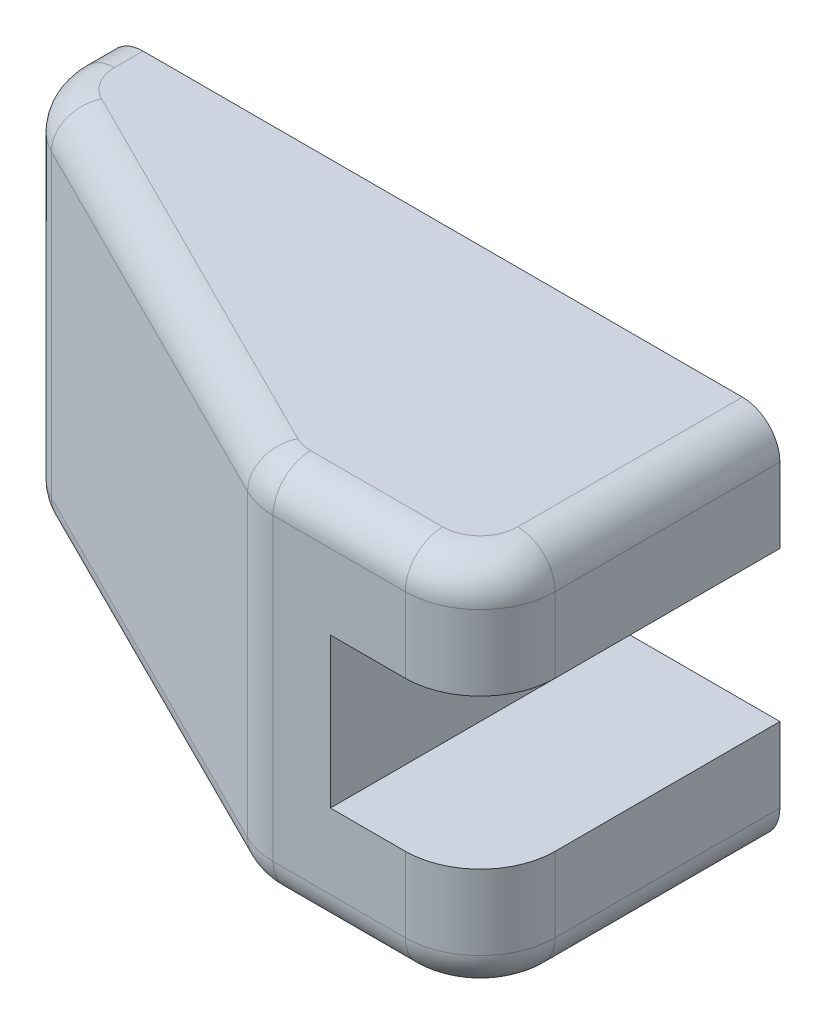
ISO-10303-21;
HEADER;
FILE_DESCRIPTION(('STEP AP214'),'2;1');
FILE_NAME('part.step','',(''),(''),'','','');
FILE_SCHEMA(('AUTOMOTIVE_DESIGN { 1 0 10303 214 1 1 1 1 }'));
ENDSEC;
DATA;
#1=APPLICATION_CONTEXT('core data for automotive mechanical design processes');
#2=APPLICATION_PROTOCOL_DEFINITION('international standard','automotive_design',2000,#1);
#3=PRODUCT_CONTEXT('',#1,'mechanical');
#4=PRODUCT('Part','Part','',(#3));
#5=PRODUCT_RELATED_PRODUCT_CATEGORY('part','',(#4));
#6=PRODUCT_DEFINITION_FORMATION('','',#4);
#7=PRODUCT_DEFINITION_CONTEXT('part definition',#1,'design');
#8=PRODUCT_DEFINITION('design','',#6,#7);
#9=PRODUCT_DEFINITION_SHAPE('','',#8);
#10=(LENGTH_UNIT() NAMED_UNIT(*) SI_UNIT(.MILLI.,.METRE.));
#11=(NAMED_UNIT(*) PLANE_ANGLE_UNIT() SI_UNIT($,.RADIAN.));
#12=(NAMED_UNIT(*) SI_UNIT($,.STERADIAN.) SOLID_ANGLE_UNIT());
#13=UNCERTAINTY_MEASURE_WITH_UNIT(LENGTH_MEASURE(1.E-05),#10,'distance_accuracy_value','');
#14=(GEOMETRIC_REPRESENTATION_CONTEXT(3) GLOBAL_UNCERTAINTY_ASSIGNED_CONTEXT((#13)) GLOBAL_UNIT_ASSIGNED_CONTEXT((#10,
#11,#12)) REPRESENTATION_CONTEXT('',''));
#15=CARTESIAN_POINT('',(0.,0.,0.));
#16=DIRECTION('',(0.,0.,1.));
#17=DIRECTION('',(1.,0.,0.));
#18=AXIS2_PLACEMENT_3D('',#15,#16,#17);
#19=CARTESIAN_POINT('',(-652.,0.,40.));
#20=DIRECTION('',(-1.,0.,0.));
#21=DIRECTION('',(0.,0.,-1.));
#22=AXIS2_PLACEMENT_3D('',#19,#20,#21);
#23=PLANE('',#22);
#24=DIRECTION('',(0.,-1.,0.));
#25=VECTOR('',#24,1.);
#26=CARTESIAN_POINT('',(-652.,0.,0.));
#27=LINE('',#26,#25);
#28=CARTESIAN_POINT('',(-652.,420.,0.));
#29=VERTEX_POINT('',#28);
#30=CARTESIAN_POINT('',(-652.,380.,0.));
#31=VERTEX_POINT('',#30);
#32=EDGE_CURVE('E228',#29,#31,#27,.T.);
#33=ORIENTED_EDGE('',*,*,#32,.T.);
#34=DIRECTION('',(0.,0.,-1.));
#35=VECTOR('',#34,1.);
#36=CARTESIAN_POINT('',(-652.,380.,3.81966011250102));
#37=LINE('',#36,#35);
#38=CARTESIAN_POINT('',(-652.,380.,3.81966011250102));
#39=VERTEX_POINT('',#38);
#40=EDGE_CURVE('E352',#31,#39,#37,.F.);
#41=ORIENTED_EDGE('',*,*,#40,.T.);
#42=DIRECTION('',(0.,1.,0.));
#43=VECTOR('',#42,1.);
#44=CARTESIAN_POINT('',(-652.,0.,3.81966011250102));
#45=LINE('',#44,#43);
#46=CARTESIAN_POINT('',(-652.,420.,3.81966011250102));
#47=VERTEX_POINT('',#46);
#48=EDGE_CURVE('E279',#39,#47,#45,.T.);
#49=ORIENTED_EDGE('',*,*,#48,.T.);
#50=DIRECTION('',(0.,0.,-1.));
#51=VECTOR('',#50,1.);
#52=CARTESIAN_POINT('',(-652.,420.,40.));
#53=LINE('',#52,#51);
#54=EDGE_CURVE('E348',#47,#29,#53,.T.);
#55=ORIENTED_EDGE('',*,*,#54,.T.);
#56=EDGE_LOOP('',(#33,#41,#49,#55));
#57=FACE_BOUND('',#56,.T.);
#58=ADVANCED_FACE('F47',(#57),#23,.T.);
#59=CARTESIAN_POINT('',(0.,425.,40.));
#60=DIRECTION('',(0.,1.,0.));
#61=DIRECTION('',(0.,0.,-1.));
#62=AXIS2_PLACEMENT_3D('',#59,#60,#61);
#63=PLANE('',#62);
#64=DIRECTION('',(-1.,0.,0.));
#65=VECTOR('',#64,1.);
#66=CARTESIAN_POINT('',(0.,425.,0.));
#67=LINE('',#66,#65);
#68=CARTESIAN_POINT('',(-567.,425.,0.));
#69=VERTEX_POINT('',#68);
#70=CARTESIAN_POINT('',(-647.,425.,0.));
#71=VERTEX_POINT('',#70);
#72=EDGE_CURVE('E206',#69,#71,#67,.T.);
#73=ORIENTED_EDGE('',*,*,#72,.T.);
#74=DIRECTION('',(0.,0.,-1.));
#75=VECTOR('',#74,1.);
#76=CARTESIAN_POINT('',(-647.,425.,40.));
#77=LINE('',#76,#75);
#78=CARTESIAN_POINT('',(-647.,425.,3.81966011250102));
#79=VERTEX_POINT('',#78);
#80=EDGE_CURVE('E73',#71,#79,#77,.F.);
#81=ORIENTED_EDGE('',*,*,#80,.T.);
#82=CARTESIAN_POINT('',(-642.,425.,3.81966011250102));
#83=DIRECTION('',(0.,1.,0.));
#84=DIRECTION('',(0.,0.,1.));
#85=AXIS2_PLACEMENT_3D('',#82,#83,#84);
#86=CIRCLE('',#85,5.);
#87=CARTESIAN_POINT('',(-644.2360679775,425.,8.2917960675006));
#88=VERTEX_POINT('',#87);
#89=EDGE_CURVE('E376',#79,#88,#86,.T.);
#90=ORIENTED_EDGE('',*,*,#89,.T.);
#91=DIRECTION('',(0.894427190999917,0.,0.447213595499956));
#92=VECTOR('',#91,1.);
#93=CARTESIAN_POINT('',(-116.163932022499,425.,272.327864045));
#94=LINE('',#93,#92);
#95=CARTESIAN_POINT('',(-591.875388202502,425.,34.4721359549996));
#96=VERTEX_POINT('',#95);
#97=EDGE_CURVE('E361',#88,#96,#94,.T.);
#98=ORIENTED_EDGE('',*,*,#97,.T.);
#99=CARTESIAN_POINT('',(-589.639320225002,425.,30.));
#100=DIRECTION('',(0.,1.,0.));
#101=DIRECTION('',(0.,0.,1.));
#102=AXIS2_PLACEMENT_3D('',#99,#100,#101);
#103=CIRCLE('',#102,5.);
#104=CARTESIAN_POINT('',(-589.639320225002,425.,35.));
#105=VERTEX_POINT('',#104);
#106=EDGE_CURVE('E364',#96,#105,#103,.T.);
#107=ORIENTED_EDGE('',*,*,#106,.T.);
#108=DIRECTION('',(-1.,0.,0.));
#109=VECTOR('',#108,1.);
#110=CARTESIAN_POINT('',(-572.,425.,35.));
#111=LINE('',#110,#109);
#112=CARTESIAN_POINT('',(-572.,425.,35.));
#113=VERTEX_POINT('',#112);
#114=EDGE_CURVE('E367',#105,#113,#111,.F.);
#115=ORIENTED_EDGE('',*,*,#114,.T.);
#116=CARTESIAN_POINT('',(-572.,425.,30.));
#117=DIRECTION('',(0.,1.,0.));
#118=DIRECTION('',(0.,0.,1.));
#119=AXIS2_PLACEMENT_3D('',#116,#117,#118);
#120=CIRCLE('',#119,5.);
#121=CARTESIAN_POINT('',(-567.,425.,30.));
#122=VERTEX_POINT('',#121);
#123=EDGE_CURVE('E370',#113,#122,#120,.T.);
#124=ORIENTED_EDGE('',*,*,#123,.T.);
#125=DIRECTION('',(0.,0.,-1.));
#126=VECTOR('',#125,1.);
#127=CARTESIAN_POINT('',(-567.,425.,40.));
#128=LINE('',#127,#126);
#129=EDGE_CURVE('E373',#122,#69,#128,.T.);
#130=ORIENTED_EDGE('',*,*,#129,.T.);
#131=EDGE_LOOP('',(#73,#81,#90,#98,#107,#115,#124,#130));
#132=FACE_BOUND('',#131,.T.);
#133=ADVANCED_FACE('F444',(#132),#63,.T.);
#134=CARTESIAN_POINT('',(-562.,0.,40.));
#135=DIRECTION('',(1.,0.,0.));
#136=DIRECTION('',(0.,0.,1.));
#137=AXIS2_PLACEMENT_3D('',#134,#135,#136);
#138=PLANE('',#137);
#139=DIRECTION('',(0.,1.,0.));
#140=VECTOR('',#139,1.);
#141=CARTESIAN_POINT('',(-562.,0.,0.));
#142=LINE('',#141,#140);
#143=CARTESIAN_POINT('',(-562.,410.,0.));
#144=VERTEX_POINT('',#143);
#145=CARTESIAN_POINT('',(-562.,420.,0.));
#146=VERTEX_POINT('',#145);
#147=EDGE_CURVE('E250',#144,#146,#142,.T.);
#148=ORIENTED_EDGE('',*,*,#147,.T.);
#149=DIRECTION('',(0.,0.,-1.));
#150=VECTOR('',#149,1.);
#151=CARTESIAN_POINT('',(-562.,420.,40.));
#152=LINE('',#151,#150);
#153=CARTESIAN_POINT('',(-562.,420.,30.));
#154=VERTEX_POINT('',#153);
#155=EDGE_CURVE('E65',#146,#154,#152,.F.);
#156=ORIENTED_EDGE('',*,*,#155,.T.);
#157=DIRECTION('',(0.,1.,0.));
#158=VECTOR('',#157,1.);
#159=CARTESIAN_POINT('',(-562.,410.,30.));
#160=LINE('',#159,#158);
#161=CARTESIAN_POINT('',(-562.,410.,30.));
#162=VERTEX_POINT('',#161);
#163=EDGE_CURVE('E290',#154,#162,#160,.F.);
#164=ORIENTED_EDGE('',*,*,#163,.T.);
#165=DIRECTION('',(0.,0.,-1.));
#166=VECTOR('',#165,1.);
#167=CARTESIAN_POINT('',(-562.,410.,40.));
#168=LINE('',#167,#166);
#169=EDGE_CURVE('E255',#162,#144,#168,.T.);
#170=ORIENTED_EDGE('',*,*,#169,.T.);
#171=EDGE_LOOP('',(#148,#156,#164,#170));
#172=FACE_BOUND('',#171,.T.);
#173=ADVANCED_FACE('F506',(#172),#138,.T.);
#174=CARTESIAN_POINT('',(0.,410.,40.));
#175=DIRECTION('',(0.,-1.,0.));
#176=DIRECTION('',(0.,0.,1.));
#177=AXIS2_PLACEMENT_3D('',#174,#175,#176);
#178=PLANE('',#177);
#179=ORIENTED_EDGE('',*,*,#169,.F.);
#180=CARTESIAN_POINT('',(-572.,410.,30.));
#181=DIRECTION('',(0.,-1.,0.));
#182=DIRECTION('',(0.,0.,-1.));
#183=AXIS2_PLACEMENT_3D('',#180,#181,#182);
#184=CIRCLE('',#183,10.);
#185=CARTESIAN_POINT('',(-572.,410.,40.));
#186=VERTEX_POINT('',#185);
#187=EDGE_CURVE('E293',#162,#186,#184,.T.);
#188=ORIENTED_EDGE('',*,*,#187,.T.);
#189=DIRECTION('',(1.,0.,0.));
#190=VECTOR('',#189,1.);
#191=CARTESIAN_POINT('',(0.,410.,40.));
#192=LINE('',#191,#190);
#193=CARTESIAN_POINT('',(-582.,410.,40.));
#194=VERTEX_POINT('',#193);
#195=EDGE_CURVE('E223',#194,#186,#192,.T.);
#196=ORIENTED_EDGE('',*,*,#195,.F.);
#197=DIRECTION('',(0.,0.,-1.));
#198=VECTOR('',#197,1.);
#199=CARTESIAN_POINT('',(-582.,410.,40.));
#200=LINE('',#199,#198);
#201=CARTESIAN_POINT('',(-582.,410.,0.));
#202=VERTEX_POINT('',#201);
#203=EDGE_CURVE('E216',#194,#202,#200,.T.);
#204=ORIENTED_EDGE('',*,*,#203,.T.);
#205=DIRECTION('',(1.,0.,0.));
#206=VECTOR('',#205,1.);
#207=CARTESIAN_POINT('',(0.,410.,0.));
#208=LINE('',#207,#206);
#209=EDGE_CURVE('E246',#202,#144,#208,.T.);
#210=ORIENTED_EDGE('',*,*,#209,.T.);
#211=EDGE_LOOP('',(#179,#188,#196,#204,#210));
#212=FACE_BOUND('',#211,.T.);
#213=ADVANCED_FACE('F502',(#212),#178,.T.);
#214=CARTESIAN_POINT('',(-582.,0.,40.));
#215=DIRECTION('',(1.,0.,0.));
#216=DIRECTION('',(0.,0.,1.));
#217=AXIS2_PLACEMENT_3D('',#214,#215,#216);
#218=PLANE('',#217);
#219=DIRECTION('',(0.,1.,0.));
#220=VECTOR('',#219,1.);
#221=CARTESIAN_POINT('',(-582.,0.,0.));
#222=LINE('',#221,#220);
#223=CARTESIAN_POINT('',(-582.,390.,0.));
#224=VERTEX_POINT('',#223);
#225=EDGE_CURVE('E243',#224,#202,#222,.T.);
#226=ORIENTED_EDGE('',*,*,#225,.T.);
#227=ORIENTED_EDGE('',*,*,#203,.F.);
#228=DIRECTION('',(0.,1.,0.));
#229=VECTOR('',#228,1.);
#230=CARTESIAN_POINT('',(-582.,0.,40.));
#231=LINE('',#230,#229);
#232=CARTESIAN_POINT('',(-582.,390.,40.));
#233=VERTEX_POINT('',#232);
#234=EDGE_CURVE('E199',#233,#194,#231,.T.);
#235=ORIENTED_EDGE('',*,*,#234,.F.);
#236=DIRECTION('',(0.,0.,-1.));
#237=VECTOR('',#236,1.);
#238=CARTESIAN_POINT('',(-582.,390.,40.));
#239=LINE('',#238,#237);
#240=EDGE_CURVE('E209',#233,#224,#239,.T.);
#241=ORIENTED_EDGE('',*,*,#240,.T.);
#242=EDGE_LOOP('',(#226,#227,#235,#241));
#243=FACE_BOUND('',#242,.T.);
#244=ADVANCED_FACE('F219',(#243),#218,.T.);
#245=CARTESIAN_POINT('',(0.,390.,40.));
#246=DIRECTION('',(0.,-1.,0.));
#247=DIRECTION('',(0.,0.,1.));
#248=AXIS2_PLACEMENT_3D('',#245,#246,#247);
#249=PLANE('',#248);
#250=DIRECTION('',(1.,0.,0.));
#251=VECTOR('',#250,1.);
#252=CARTESIAN_POINT('',(0.,390.,40.));
#253=LINE('',#252,#251);
#254=CARTESIAN_POINT('',(-572.,390.,40.));
#255=VERTEX_POINT('',#254);
#256=EDGE_CURVE('E193',#233,#255,#253,.T.);
#257=ORIENTED_EDGE('',*,*,#256,.T.);
#258=CARTESIAN_POINT('',(-572.,390.,30.));
#259=DIRECTION('',(0.,-1.,0.));
#260=DIRECTION('',(0.,0.,-1.));
#261=AXIS2_PLACEMENT_3D('',#258,#259,#260);
#262=CIRCLE('',#261,10.);
#263=CARTESIAN_POINT('',(-562.,390.,30.));
#264=VERTEX_POINT('',#263);
#265=EDGE_CURVE('E287',#255,#264,#262,.F.);
#266=ORIENTED_EDGE('',*,*,#265,.T.);
#267=DIRECTION('',(0.,0.,-1.));
#268=VECTOR('',#267,1.);
#269=CARTESIAN_POINT('',(-562.,390.,40.));
#270=LINE('',#269,#268);
#271=CARTESIAN_POINT('',(-562.,390.,0.));
#272=VERTEX_POINT('',#271);
#273=EDGE_CURVE('E217',#264,#272,#270,.T.);
#274=ORIENTED_EDGE('',*,*,#273,.T.);
#275=DIRECTION('',(1.,0.,0.));
#276=VECTOR('',#275,1.);
#277=CARTESIAN_POINT('',(0.,390.,0.));
#278=LINE('',#277,#276);
#279=EDGE_CURVE('E212',#224,#272,#278,.T.);
#280=ORIENTED_EDGE('',*,*,#279,.F.);
#281=ORIENTED_EDGE('',*,*,#240,.F.);
#282=EDGE_LOOP('',(#257,#266,#274,#280,#281));
#283=FACE_BOUND('',#282,.T.);
#284=ADVANCED_FACE('F210',(#283),#249,.F.);
#285=CARTESIAN_POINT('',(-562.,0.,40.));
#286=DIRECTION('',(-1.,0.,0.));
#287=DIRECTION('',(0.,0.,-1.));
#288=AXIS2_PLACEMENT_3D('',#285,#286,#287);
#289=PLANE('',#288);
#290=DIRECTION('',(0.,-1.,0.));
#291=VECTOR('',#290,1.);
#292=CARTESIAN_POINT('',(-562.,0.,30.));
#293=LINE('',#292,#291);
#294=CARTESIAN_POINT('',(-562.,380.,30.));
#295=VERTEX_POINT('',#294);
#296=EDGE_CURVE('E283',#264,#295,#293,.T.);
#297=ORIENTED_EDGE('',*,*,#296,.T.);
#298=DIRECTION('',(0.,0.,-1.));
#299=VECTOR('',#298,1.);
#300=CARTESIAN_POINT('',(-562.,380.,40.));
#301=LINE('',#300,#299);
#302=CARTESIAN_POINT('',(-562.,380.,0.));
#303=VERTEX_POINT('',#302);
#304=EDGE_CURVE('E296',#295,#303,#301,.T.);
#305=ORIENTED_EDGE('',*,*,#304,.T.);
#306=DIRECTION('',(0.,-1.,0.));
#307=VECTOR('',#306,1.);
#308=CARTESIAN_POINT('',(-562.,0.,0.));
#309=LINE('',#308,#307);
#310=EDGE_CURVE('E237',#272,#303,#309,.T.);
#311=ORIENTED_EDGE('',*,*,#310,.F.);
#312=ORIENTED_EDGE('',*,*,#273,.F.);
#313=EDGE_LOOP('',(#297,#305,#311,#312));
#314=FACE_BOUND('',#313,.T.);
#315=ADVANCED_FACE('F496',(#314),#289,.F.);
#316=CARTESIAN_POINT('',(0.,375.,40.));
#317=DIRECTION('',(0.,1.,0.));
#318=DIRECTION('',(0.,0.,-1.));
#319=AXIS2_PLACEMENT_3D('',#316,#317,#318);
#320=PLANE('',#319);
#321=DIRECTION('',(-1.,0.,0.));
#322=VECTOR('',#321,1.);
#323=CARTESIAN_POINT('',(0.,375.,0.));
#324=LINE('',#323,#322);
#325=CARTESIAN_POINT('',(-567.,375.,0.));
#326=VERTEX_POINT('',#325);
#327=CARTESIAN_POINT('',(-647.,375.,0.));
#328=VERTEX_POINT('',#327);
#329=EDGE_CURVE('E232',#326,#328,#324,.T.);
#330=ORIENTED_EDGE('',*,*,#329,.F.);
#331=DIRECTION('',(0.,0.,-1.));
#332=VECTOR('',#331,1.);
#333=CARTESIAN_POINT('',(-567.,375.,40.));
#334=LINE('',#333,#332);
#335=CARTESIAN_POINT('',(-567.,375.,30.));
#336=VERTEX_POINT('',#335);
#337=EDGE_CURVE('E330',#326,#336,#334,.F.);
#338=ORIENTED_EDGE('',*,*,#337,.T.);
#339=CARTESIAN_POINT('',(-572.,375.,30.));
#340=DIRECTION('',(0.,1.,0.));
#341=DIRECTION('',(0.,0.,1.));
#342=AXIS2_PLACEMENT_3D('',#339,#340,#341);
#343=CIRCLE('',#342,5.);
#344=CARTESIAN_POINT('',(-572.,375.,35.));
#345=VERTEX_POINT('',#344);
#346=EDGE_CURVE('E327',#336,#345,#343,.F.);
#347=ORIENTED_EDGE('',*,*,#346,.T.);
#348=DIRECTION('',(-1.,0.,0.));
#349=VECTOR('',#348,1.);
#350=CARTESIAN_POINT('',(0.,375.,35.));
#351=LINE('',#350,#349);
#352=CARTESIAN_POINT('',(-589.639320225002,375.,35.));
#353=VERTEX_POINT('',#352);
#354=EDGE_CURVE('E324',#345,#353,#351,.T.);
#355=ORIENTED_EDGE('',*,*,#354,.T.);
#356=CARTESIAN_POINT('',(-589.639320225002,375.,30.));
#357=DIRECTION('',(0.,1.,0.));
#358=DIRECTION('',(0.,0.,1.));
#359=AXIS2_PLACEMENT_3D('',#356,#357,#358);
#360=CIRCLE('',#359,5.);
#361=CARTESIAN_POINT('',(-591.875388202502,375.,34.4721359549996));
#362=VERTEX_POINT('',#361);
#363=EDGE_CURVE('E321',#353,#362,#360,.F.);
#364=ORIENTED_EDGE('',*,*,#363,.T.);
#365=DIRECTION('',(-0.894427190999917,0.,-0.447213595499956));
#366=VECTOR('',#365,1.);
#367=CARTESIAN_POINT('',(-644.2360679775,375.,8.29179606750052));
#368=LINE('',#367,#366);
#369=CARTESIAN_POINT('',(-644.2360679775,375.,8.29179606750059));
#370=VERTEX_POINT('',#369);
#371=EDGE_CURVE('E312',#362,#370,#368,.T.);
#372=ORIENTED_EDGE('',*,*,#371,.T.);
#373=CARTESIAN_POINT('',(-642.,375.,3.81966011250102));
#374=DIRECTION('',(0.,1.,0.));
#375=DIRECTION('',(0.,0.,1.));
#376=AXIS2_PLACEMENT_3D('',#373,#374,#375);
#377=CIRCLE('',#376,5.);
#378=CARTESIAN_POINT('',(-647.,375.,3.81966011250102));
#379=VERTEX_POINT('',#378);
#380=EDGE_CURVE('E315',#370,#379,#377,.F.);
#381=ORIENTED_EDGE('',*,*,#380,.T.);
#382=DIRECTION('',(0.,0.,-1.));
#383=VECTOR('',#382,1.);
#384=CARTESIAN_POINT('',(-647.,375.,0.));
#385=LINE('',#384,#383);
#386=EDGE_CURVE('E318',#379,#328,#385,.T.);
#387=ORIENTED_EDGE('',*,*,#386,.T.);
#388=EDGE_LOOP('',(#330,#338,#347,#355,#364,#372,#381,#387));
#389=FACE_BOUND('',#388,.T.);
#390=ADVANCED_FACE('F521',(#389),#320,.F.);
#391=CARTESIAN_POINT('',(0.,0.,40.));
#392=DIRECTION('',(0.,0.,-1.));
#393=DIRECTION('',(1.,0.,0.));
#394=AXIS2_PLACEMENT_3D('',#391,#392,#393);
#395=PLANE('',#394);
#396=DIRECTION('',(0.,-1.,0.));
#397=VECTOR('',#396,1.);
#398=CARTESIAN_POINT('',(-589.639320225002,375.,40.));
#399=LINE('',#398,#397);
#400=CARTESIAN_POINT('',(-589.639320225002,420.,40.));
#401=VERTEX_POINT('',#400);
#402=CARTESIAN_POINT('',(-589.639320225002,380.,40.));
#403=VERTEX_POINT('',#402);
#404=EDGE_CURVE('E268',#401,#403,#399,.T.);
#405=ORIENTED_EDGE('',*,*,#404,.T.);
#406=DIRECTION('',(-1.,0.,0.));
#407=VECTOR('',#406,1.);
#408=CARTESIAN_POINT('',(0.,380.,40.));
#409=LINE('',#408,#407);
#410=CARTESIAN_POINT('',(-572.,380.,40.));
#411=VERTEX_POINT('',#410);
#412=EDGE_CURVE('E339',#403,#411,#409,.F.);
#413=ORIENTED_EDGE('',*,*,#412,.T.);
#414=DIRECTION('',(0.,-1.,0.));
#415=VECTOR('',#414,1.);
#416=CARTESIAN_POINT('',(-572.,0.,40.));
#417=LINE('',#416,#415);
#418=EDGE_CURVE('E202',#411,#255,#417,.F.);
#419=ORIENTED_EDGE('',*,*,#418,.T.);
#420=ORIENTED_EDGE('',*,*,#256,.F.);
#421=ORIENTED_EDGE('',*,*,#234,.T.);
#422=ORIENTED_EDGE('',*,*,#195,.T.);
#423=DIRECTION('',(0.,1.,0.));
#424=VECTOR('',#423,1.);
#425=CARTESIAN_POINT('',(-572.,425.,40.));
#426=LINE('',#425,#424);
#427=CARTESIAN_POINT('',(-572.,420.,40.));
#428=VERTEX_POINT('',#427);
#429=EDGE_CURVE('E258',#186,#428,#426,.T.);
#430=ORIENTED_EDGE('',*,*,#429,.T.);
#431=DIRECTION('',(-1.,0.,0.));
#432=VECTOR('',#431,1.);
#433=CARTESIAN_POINT('',(-589.639320225002,420.,40.));
#434=LINE('',#433,#432);
#435=EDGE_CURVE('E336',#428,#401,#434,.T.);
#436=ORIENTED_EDGE('',*,*,#435,.T.);
#437=EDGE_LOOP('',(#405,#413,#419,#420,#421,#422,#430,#436));
#438=FACE_BOUND('',#437,.T.);
#439=ADVANCED_FACE('F196',(#438),#395,.F.);
#440=CARTESIAN_POINT('',(0.,0.,0.));
#441=DIRECTION('',(0.,0.,-1.));
#442=DIRECTION('',(1.,0.,0.));
#443=AXIS2_PLACEMENT_3D('',#440,#441,#442);
#444=PLANE('',#443);
#445=ORIENTED_EDGE('',*,*,#310,.T.);
#446=CARTESIAN_POINT('',(-567.,380.,0.));
#447=DIRECTION('',(0.,0.,-1.));
#448=DIRECTION('',(-1.,0.,0.));
#449=AXIS2_PLACEMENT_3D('',#446,#447,#448);
#450=CIRCLE('',#449,5.);
#451=EDGE_CURVE('E309',#303,#326,#450,.T.);
#452=ORIENTED_EDGE('',*,*,#451,.T.);
#453=ORIENTED_EDGE('',*,*,#329,.T.);
#454=CARTESIAN_POINT('',(-647.,380.,0.));
#455=DIRECTION('',(0.,0.,-1.));
#456=DIRECTION('',(-1.,0.,0.));
#457=AXIS2_PLACEMENT_3D('',#454,#455,#456);
#458=CIRCLE('',#457,5.);
#459=EDGE_CURVE('E306',#328,#31,#458,.T.);
#460=ORIENTED_EDGE('',*,*,#459,.T.);
#461=ORIENTED_EDGE('',*,*,#32,.F.);
#462=CARTESIAN_POINT('',(-647.,420.,0.));
#463=DIRECTION('',(0.,0.,-1.));
#464=DIRECTION('',(-1.,0.,0.));
#465=AXIS2_PLACEMENT_3D('',#462,#463,#464);
#466=CIRCLE('',#465,5.);
#467=EDGE_CURVE('E303',#29,#71,#466,.T.);
#468=ORIENTED_EDGE('',*,*,#467,.T.);
#469=ORIENTED_EDGE('',*,*,#72,.F.);
#470=CARTESIAN_POINT('',(-567.,420.,0.));
#471=DIRECTION('',(0.,0.,-1.));
#472=DIRECTION('',(-1.,0.,0.));
#473=AXIS2_PLACEMENT_3D('',#470,#471,#472);
#474=CIRCLE('',#473,5.);
#475=EDGE_CURVE('E300',#69,#146,#474,.T.);
#476=ORIENTED_EDGE('',*,*,#475,.T.);
#477=ORIENTED_EDGE('',*,*,#147,.F.);
#478=ORIENTED_EDGE('',*,*,#209,.F.);
#479=ORIENTED_EDGE('',*,*,#225,.F.);
#480=ORIENTED_EDGE('',*,*,#279,.T.);
#481=EDGE_LOOP('',(#445,#452,#453,#460,#461,#468,#469,#476,#477,#478,#479,#480));
#482=FACE_BOUND('',#481,.T.);
#483=ADVANCED_FACE('F446',(#482),#444,.T.);
#484=CARTESIAN_POINT('',(-592.,0.,40.));
#485=DIRECTION('',(-0.447213595499956,0.,0.894427190999917));
#486=DIRECTION('',(0.,1.,0.));
#487=AXIS2_PLACEMENT_3D('',#484,#485,#486);
#488=PLANE('',#487);
#489=DIRECTION('',(0.,1.,0.));
#490=VECTOR('',#489,1.);
#491=CARTESIAN_POINT('',(-646.472135955,0.,12.7639320225002));
#492=LINE('',#491,#490);
#493=CARTESIAN_POINT('',(-646.472135955,420.,12.7639320225002));
#494=VERTEX_POINT('',#493);
#495=CARTESIAN_POINT('',(-646.472135955,380.,12.7639320225002));
#496=VERTEX_POINT('',#495);
#497=EDGE_CURVE('E271',#494,#496,#492,.F.);
#498=ORIENTED_EDGE('',*,*,#497,.T.);
#499=DIRECTION('',(-0.894427190999917,0.,-0.447213595499956));
#500=VECTOR('',#499,1.);
#501=CARTESIAN_POINT('',(-594.111456180001,380.,38.9442719099991));
#502=LINE('',#501,#500);
#503=CARTESIAN_POINT('',(-594.111456180001,380.,38.9442719099992));
#504=VERTEX_POINT('',#503);
#505=EDGE_CURVE('E11',#496,#504,#502,.F.);
#506=ORIENTED_EDGE('',*,*,#505,.T.);
#507=DIRECTION('',(0.,-1.,0.));
#508=VECTOR('',#507,1.);
#509=CARTESIAN_POINT('',(-594.111456180001,425.,38.9442719099992));
#510=LINE('',#509,#508);
#511=CARTESIAN_POINT('',(-594.111456180001,420.,38.9442719099992));
#512=VERTEX_POINT('',#511);
#513=EDGE_CURVE('E275',#504,#512,#510,.F.);
#514=ORIENTED_EDGE('',*,*,#513,.T.);
#515=DIRECTION('',(0.894427190999917,0.,0.447213595499956));
#516=VECTOR('',#515,1.);
#517=CARTESIAN_POINT('',(-592.,420.,40.));
#518=LINE('',#517,#516);
#519=EDGE_CURVE('E57',#512,#494,#518,.F.);
#520=ORIENTED_EDGE('',*,*,#519,.T.);
#521=EDGE_LOOP('',(#498,#506,#514,#520));
#522=FACE_BOUND('',#521,.T.);
#523=ADVANCED_FACE('F524',(#522),#488,.T.);
#524=CARTESIAN_POINT('',(-589.639320225002,0.,30.));
#525=DIRECTION('',(0.,1.,0.));
#526=DIRECTION('',(0.,0.,1.));
#527=AXIS2_PLACEMENT_3D('',#524,#525,#526);
#528=CYLINDRICAL_SURFACE('',#527,10.);
#529=ORIENTED_EDGE('',*,*,#513,.F.);
#530=CARTESIAN_POINT('',(-589.639320225002,380.,30.));
#531=DIRECTION('',(0.,1.,0.));
#532=DIRECTION('',(0.,0.,1.));
#533=AXIS2_PLACEMENT_3D('',#530,#531,#532);
#534=CIRCLE('',#533,10.);
#535=EDGE_CURVE('E345',#504,#403,#534,.T.);
#536=ORIENTED_EDGE('',*,*,#535,.T.);
#537=ORIENTED_EDGE('',*,*,#404,.F.);
#538=CARTESIAN_POINT('',(-589.639320225002,420.,30.));
#539=DIRECTION('',(0.,1.,0.));
#540=DIRECTION('',(0.,0.,1.));
#541=AXIS2_PLACEMENT_3D('',#538,#539,#540);
#542=CIRCLE('',#541,10.);
#543=EDGE_CURVE('E342',#401,#512,#542,.F.);
#544=ORIENTED_EDGE('',*,*,#543,.T.);
#545=EDGE_LOOP('',(#529,#536,#537,#544));
#546=FACE_BOUND('',#545,.T.);
#547=ADVANCED_FACE('F478',(#546),#528,.T.);
#548=CARTESIAN_POINT('',(-642.,0.,3.81966011250102));
#549=DIRECTION('',(0.,1.,0.));
#550=DIRECTION('',(0.,0.,1.));
#551=AXIS2_PLACEMENT_3D('',#548,#549,#550);
#552=CYLINDRICAL_SURFACE('',#551,10.);
#553=ORIENTED_EDGE('',*,*,#48,.F.);
#554=CARTESIAN_POINT('',(-642.,380.,3.81966011250102));
#555=DIRECTION('',(0.,1.,0.));
#556=DIRECTION('',(0.,0.,1.));
#557=AXIS2_PLACEMENT_3D('',#554,#555,#556);
#558=CIRCLE('',#557,10.);
#559=EDGE_CURVE('E358',#39,#496,#558,.T.);
#560=ORIENTED_EDGE('',*,*,#559,.T.);
#561=ORIENTED_EDGE('',*,*,#497,.F.);
#562=CARTESIAN_POINT('',(-642.,420.,3.81966011250102));
#563=DIRECTION('',(0.,1.,0.));
#564=DIRECTION('',(0.,0.,1.));
#565=AXIS2_PLACEMENT_3D('',#562,#563,#564);
#566=CIRCLE('',#565,10.);
#567=EDGE_CURVE('E355',#494,#47,#566,.F.);
#568=ORIENTED_EDGE('',*,*,#567,.T.);
#569=EDGE_LOOP('',(#553,#560,#561,#568));
#570=FACE_BOUND('',#569,.T.);
#571=ADVANCED_FACE('F532',(#570),#552,.T.);
#572=CARTESIAN_POINT('',(-572.,0.,30.));
#573=DIRECTION('',(0.,-1.,0.));
#574=DIRECTION('',(0.,0.,-1.));
#575=AXIS2_PLACEMENT_3D('',#572,#573,#574);
#576=CYLINDRICAL_SURFACE('',#575,10.);
#577=ORIENTED_EDGE('',*,*,#418,.F.);
#578=CARTESIAN_POINT('',(-572.,380.,30.));
#579=DIRECTION('',(0.,1.,0.));
#580=DIRECTION('',(0.,0.,1.));
#581=AXIS2_PLACEMENT_3D('',#578,#579,#580);
#582=CIRCLE('',#581,10.);
#583=EDGE_CURVE('E333',#411,#295,#582,.T.);
#584=ORIENTED_EDGE('',*,*,#583,.T.);
#585=ORIENTED_EDGE('',*,*,#296,.F.);
#586=ORIENTED_EDGE('',*,*,#265,.F.);
#587=EDGE_LOOP('',(#577,#584,#585,#586));
#588=FACE_BOUND('',#587,.T.);
#589=ADVANCED_FACE('F491',(#588),#576,.T.);
#590=CARTESIAN_POINT('',(-572.,0.,30.));
#591=DIRECTION('',(0.,-1.,0.));
#592=DIRECTION('',(0.,0.,-1.));
#593=AXIS2_PLACEMENT_3D('',#590,#591,#592);
#594=CYLINDRICAL_SURFACE('',#593,10.);
#595=ORIENTED_EDGE('',*,*,#163,.F.);
#596=CARTESIAN_POINT('',(-572.,420.,30.));
#597=DIRECTION('',(0.,1.,0.));
#598=DIRECTION('',(0.,0.,1.));
#599=AXIS2_PLACEMENT_3D('',#596,#597,#598);
#600=CIRCLE('',#599,10.);
#601=EDGE_CURVE('E383',#154,#428,#600,.F.);
#602=ORIENTED_EDGE('',*,*,#601,.T.);
#603=ORIENTED_EDGE('',*,*,#429,.F.);
#604=ORIENTED_EDGE('',*,*,#187,.F.);
#605=EDGE_LOOP('',(#595,#602,#603,#604));
#606=FACE_BOUND('',#605,.T.);
#607=ADVANCED_FACE('F505',(#606),#594,.T.);
#608=CARTESIAN_POINT('',(-647.,380.,40.));
#609=DIRECTION('',(0.,0.,1.));
#610=DIRECTION('',(1.,0.,0.));
#611=AXIS2_PLACEMENT_3D('',#608,#609,#610);
#612=CYLINDRICAL_SURFACE('',#611,5.);
#613=ORIENTED_EDGE('',*,*,#459,.F.);
#614=ORIENTED_EDGE('',*,*,#386,.F.);
#615=CARTESIAN_POINT('',(-647.,380.,3.81966011250102));
#616=DIRECTION('',(0.,0.,1.));
#617=DIRECTION('',(1.,0.,0.));
#618=AXIS2_PLACEMENT_3D('',#615,#616,#617);
#619=CIRCLE('',#618,5.);
#620=EDGE_CURVE('E233',#39,#379,#619,.T.);
#621=ORIENTED_EDGE('',*,*,#620,.F.);
#622=ORIENTED_EDGE('',*,*,#40,.F.);
#623=EDGE_LOOP('',(#613,#614,#621,#622));
#624=FACE_BOUND('',#623,.T.);
#625=ADVANCED_FACE('F539',(#624),#612,.T.);
#626=CARTESIAN_POINT('',(-642.,380.,3.81966011250102));
#627=DIRECTION('',(0.,1.,0.));
#628=DIRECTION('',(0.,0.,1.));
#629=AXIS2_PLACEMENT_3D('',#626,#627,#628);
#630=DEGENERATE_TOROIDAL_SURFACE('',#629,5.,5.,.T.);
#631=ORIENTED_EDGE('',*,*,#620,.T.);
#632=ORIENTED_EDGE('',*,*,#380,.F.);
#633=CARTESIAN_POINT('',(-644.2360679775,380.,8.29179606750061));
#634=DIRECTION('',(0.894427190999919,0.,0.447213595499951));
#635=DIRECTION('',(0.447213595499951,0.,-0.894427190999919));
#636=AXIS2_PLACEMENT_3D('',#633,#634,#635);
#637=CIRCLE('',#636,5.);
#638=EDGE_CURVE('E404',#496,#370,#637,.T.);
#639=ORIENTED_EDGE('',*,*,#638,.F.);
#640=ORIENTED_EDGE('',*,*,#559,.F.);
#641=EDGE_LOOP('',(#631,#632,#639,#640));
#642=FACE_BOUND('',#641,.T.);
#643=ADVANCED_FACE('F555',(#642),#630,.T.);
#644=CARTESIAN_POINT('',(-116.163932022499,380.,272.327864045));
#645=DIRECTION('',(0.894427190999917,0.,0.447213595499956));
#646=DIRECTION('',(0.447213595499956,0.,-0.894427190999917));
#647=AXIS2_PLACEMENT_3D('',#644,#645,#646);
#648=CYLINDRICAL_SURFACE('',#647,5.);
#649=ORIENTED_EDGE('',*,*,#638,.T.);
#650=ORIENTED_EDGE('',*,*,#371,.F.);
#651=CARTESIAN_POINT('',(-591.875388202502,380.,34.4721359549996));
#652=DIRECTION('',(0.894427190999919,0.,0.447213595499952));
#653=DIRECTION('',(0.447213595499952,0.,-0.894427190999919));
#654=AXIS2_PLACEMENT_3D('',#651,#652,#653);
#655=CIRCLE('',#654,5.);
#656=EDGE_CURVE('E400',#504,#362,#655,.T.);
#657=ORIENTED_EDGE('',*,*,#656,.F.);
#658=ORIENTED_EDGE('',*,*,#505,.F.);
#659=EDGE_LOOP('',(#649,#650,#657,#658));
#660=FACE_BOUND('',#659,.T.);
#661=ADVANCED_FACE('F552',(#660),#648,.T.);
#662=CARTESIAN_POINT('',(-589.639320225002,380.,30.));
#663=DIRECTION('',(0.,1.,0.));
#664=DIRECTION('',(0.,0.,1.));
#665=AXIS2_PLACEMENT_3D('',#662,#663,#664);
#666=DEGENERATE_TOROIDAL_SURFACE('',#665,5.,5.,.T.);
#667=ORIENTED_EDGE('',*,*,#656,.T.);
#668=ORIENTED_EDGE('',*,*,#363,.F.);
#669=CARTESIAN_POINT('',(-589.639320225002,380.,35.));
#670=DIRECTION('',(1.,0.,0.));
#671=DIRECTION('',(0.,0.,-1.));
#672=AXIS2_PLACEMENT_3D('',#669,#670,#671);
#673=CIRCLE('',#672,5.);
#674=EDGE_CURVE('E396',#403,#353,#673,.T.);
#675=ORIENTED_EDGE('',*,*,#674,.F.);
#676=ORIENTED_EDGE('',*,*,#535,.F.);
#677=EDGE_LOOP('',(#667,#668,#675,#676));
#678=FACE_BOUND('',#677,.T.);
#679=ADVANCED_FACE('F482',(#678),#666,.T.);
#680=CARTESIAN_POINT('',(0.,380.,35.));
#681=DIRECTION('',(-1.,0.,0.));
#682=DIRECTION('',(0.,0.,1.));
#683=AXIS2_PLACEMENT_3D('',#680,#681,#682);
#684=CYLINDRICAL_SURFACE('',#683,5.);
#685=ORIENTED_EDGE('',*,*,#674,.T.);
#686=ORIENTED_EDGE('',*,*,#354,.F.);
#687=CARTESIAN_POINT('',(-572.,380.,35.));
#688=DIRECTION('',(1.,0.,0.));
#689=DIRECTION('',(0.,0.,-1.));
#690=AXIS2_PLACEMENT_3D('',#687,#688,#689);
#691=CIRCLE('',#690,5.);
#692=EDGE_CURVE('E392',#411,#345,#691,.T.);
#693=ORIENTED_EDGE('',*,*,#692,.F.);
#694=ORIENTED_EDGE('',*,*,#412,.F.);
#695=EDGE_LOOP('',(#685,#686,#693,#694));
#696=FACE_BOUND('',#695,.T.);
#697=ADVANCED_FACE('F488',(#696),#684,.T.);
#698=CARTESIAN_POINT('',(-572.,380.,30.));
#699=DIRECTION('',(0.,1.,0.));
#700=DIRECTION('',(0.,0.,1.));
#701=AXIS2_PLACEMENT_3D('',#698,#699,#700);
#702=DEGENERATE_TOROIDAL_SURFACE('',#701,5.,5.,.T.);
#703=ORIENTED_EDGE('',*,*,#692,.T.);
#704=ORIENTED_EDGE('',*,*,#346,.F.);
#705=CARTESIAN_POINT('',(-567.,380.,30.));
#706=DIRECTION('',(0.,0.,-1.));
#707=DIRECTION('',(-1.,0.,0.));
#708=AXIS2_PLACEMENT_3D('',#705,#706,#707);
#709=CIRCLE('',#708,5.);
#710=EDGE_CURVE('E388',#295,#336,#709,.T.);
#711=ORIENTED_EDGE('',*,*,#710,.F.);
#712=ORIENTED_EDGE('',*,*,#583,.F.);
#713=EDGE_LOOP('',(#703,#704,#711,#712));
#714=FACE_BOUND('',#713,.T.);
#715=ADVANCED_FACE('F543',(#714),#702,.T.);
#716=CARTESIAN_POINT('',(-567.,380.,40.));
#717=DIRECTION('',(0.,0.,-1.));
#718=DIRECTION('',(-1.,0.,0.));
#719=AXIS2_PLACEMENT_3D('',#716,#717,#718);
#720=CYLINDRICAL_SURFACE('',#719,5.);
#721=ORIENTED_EDGE('',*,*,#710,.T.);
#722=ORIENTED_EDGE('',*,*,#337,.F.);
#723=ORIENTED_EDGE('',*,*,#451,.F.);
#724=ORIENTED_EDGE('',*,*,#304,.F.);
#725=EDGE_LOOP('',(#721,#722,#723,#724));
#726=FACE_BOUND('',#725,.T.);
#727=ADVANCED_FACE('F540',(#726),#720,.T.);
#728=CARTESIAN_POINT('',(-567.,420.,40.));
#729=DIRECTION('',(0.,0.,-1.));
#730=DIRECTION('',(-1.,0.,0.));
#731=AXIS2_PLACEMENT_3D('',#728,#729,#730);
#732=CYLINDRICAL_SURFACE('',#731,5.);
#733=ORIENTED_EDGE('',*,*,#475,.F.);
#734=ORIENTED_EDGE('',*,*,#129,.F.);
#735=CARTESIAN_POINT('',(-567.,420.,30.));
#736=DIRECTION('',(0.,0.,1.));
#737=DIRECTION('',(1.,0.,0.));
#738=AXIS2_PLACEMENT_3D('',#735,#736,#737);
#739=CIRCLE('',#738,5.);
#740=EDGE_CURVE('E51',#154,#122,#739,.T.);
#741=ORIENTED_EDGE('',*,*,#740,.F.);
#742=ORIENTED_EDGE('',*,*,#155,.F.);
#743=EDGE_LOOP('',(#733,#734,#741,#742));
#744=FACE_BOUND('',#743,.T.);
#745=ADVANCED_FACE('F49',(#744),#732,.T.);
#746=CARTESIAN_POINT('',(-572.,420.,30.));
#747=DIRECTION('',(0.,1.,0.));
#748=DIRECTION('',(0.,0.,1.));
#749=AXIS2_PLACEMENT_3D('',#746,#747,#748);
#750=DEGENERATE_TOROIDAL_SURFACE('',#749,5.,5.,.T.);
#751=ORIENTED_EDGE('',*,*,#740,.T.);
#752=ORIENTED_EDGE('',*,*,#123,.F.);
#753=CARTESIAN_POINT('',(-572.,420.,35.));
#754=DIRECTION('',(-1.,0.,0.));
#755=DIRECTION('',(0.,0.,1.));
#756=AXIS2_PLACEMENT_3D('',#753,#754,#755);
#757=CIRCLE('',#756,5.);
#758=EDGE_CURVE('E426',#428,#113,#757,.T.);
#759=ORIENTED_EDGE('',*,*,#758,.F.);
#760=ORIENTED_EDGE('',*,*,#601,.F.);
#761=EDGE_LOOP('',(#751,#752,#759,#760));
#762=FACE_BOUND('',#761,.T.);
#763=ADVANCED_FACE('F439',(#762),#750,.T.);
#764=CARTESIAN_POINT('',(0.,420.,35.));
#765=DIRECTION('',(1.,0.,0.));
#766=DIRECTION('',(0.,0.,-1.));
#767=AXIS2_PLACEMENT_3D('',#764,#765,#766);
#768=CYLINDRICAL_SURFACE('',#767,5.);
#769=ORIENTED_EDGE('',*,*,#758,.T.);
#770=ORIENTED_EDGE('',*,*,#114,.F.);
#771=CARTESIAN_POINT('',(-589.639320225002,420.,35.));
#772=DIRECTION('',(-1.,0.,0.));
#773=DIRECTION('',(0.,0.,1.));
#774=AXIS2_PLACEMENT_3D('',#771,#772,#773);
#775=CIRCLE('',#774,5.);
#776=EDGE_CURVE('E423',#401,#105,#775,.T.);
#777=ORIENTED_EDGE('',*,*,#776,.F.);
#778=ORIENTED_EDGE('',*,*,#435,.F.);
#779=EDGE_LOOP('',(#769,#770,#777,#778));
#780=FACE_BOUND('',#779,.T.);
#781=ADVANCED_FACE('F472',(#780),#768,.T.);
#782=CARTESIAN_POINT('',(-589.639320225002,420.,30.));
#783=DIRECTION('',(0.,1.,0.));
#784=DIRECTION('',(0.,0.,1.));
#785=AXIS2_PLACEMENT_3D('',#782,#783,#784);
#786=DEGENERATE_TOROIDAL_SURFACE('',#785,5.,5.,.T.);
#787=ORIENTED_EDGE('',*,*,#776,.T.);
#788=ORIENTED_EDGE('',*,*,#106,.F.);
#789=CARTESIAN_POINT('',(-591.875388202502,420.,34.4721359549996));
#790=DIRECTION('',(-0.894427190999918,0.,-0.447213595499954));
#791=DIRECTION('',(-0.447213595499954,0.,0.894427190999918));
#792=AXIS2_PLACEMENT_3D('',#789,#790,#791);
#793=CIRCLE('',#792,5.);
#794=EDGE_CURVE('E419',#512,#96,#793,.T.);
#795=ORIENTED_EDGE('',*,*,#794,.F.);
#796=ORIENTED_EDGE('',*,*,#543,.F.);
#797=EDGE_LOOP('',(#787,#788,#795,#796));
#798=FACE_BOUND('',#797,.T.);
#799=ADVANCED_FACE('F470',(#798),#786,.T.);
#800=CARTESIAN_POINT('',(-116.163932022499,420.,272.327864045));
#801=DIRECTION('',(0.894427190999917,0.,0.447213595499956));
#802=DIRECTION('',(0.447213595499956,0.,-0.894427190999917));
#803=AXIS2_PLACEMENT_3D('',#800,#801,#802);
#804=CYLINDRICAL_SURFACE('',#803,5.);
#805=ORIENTED_EDGE('',*,*,#794,.T.);
#806=ORIENTED_EDGE('',*,*,#97,.F.);
#807=CARTESIAN_POINT('',(-644.2360679775,420.,8.29179606750061));
#808=DIRECTION('',(-0.894427190999919,0.,-0.447213595499952));
#809=DIRECTION('',(-0.447213595499952,0.,0.894427190999919));
#810=AXIS2_PLACEMENT_3D('',#807,#808,#809);
#811=CIRCLE('',#810,5.);
#812=EDGE_CURVE('E415',#494,#88,#811,.T.);
#813=ORIENTED_EDGE('',*,*,#812,.F.);
#814=ORIENTED_EDGE('',*,*,#519,.F.);
#815=EDGE_LOOP('',(#805,#806,#813,#814));
#816=FACE_BOUND('',#815,.T.);
#817=ADVANCED_FACE('F465',(#816),#804,.T.);
#818=CARTESIAN_POINT('',(-642.,420.,3.81966011250102));
#819=DIRECTION('',(0.,1.,0.));
#820=DIRECTION('',(0.,0.,1.));
#821=AXIS2_PLACEMENT_3D('',#818,#819,#820);
#822=DEGENERATE_TOROIDAL_SURFACE('',#821,5.,5.,.T.);
#823=ORIENTED_EDGE('',*,*,#812,.T.);
#824=ORIENTED_EDGE('',*,*,#89,.F.);
#825=CARTESIAN_POINT('',(-647.,420.,3.81966011250102));
#826=DIRECTION('',(0.,0.,-1.));
#827=DIRECTION('',(-1.,0.,0.));
#828=AXIS2_PLACEMENT_3D('',#825,#826,#827);
#829=CIRCLE('',#828,5.);
#830=EDGE_CURVE('E411',#47,#79,#829,.T.);
#831=ORIENTED_EDGE('',*,*,#830,.F.);
#832=ORIENTED_EDGE('',*,*,#567,.F.);
#833=EDGE_LOOP('',(#823,#824,#831,#832));
#834=FACE_BOUND('',#833,.T.);
#835=ADVANCED_FACE('F460',(#834),#822,.T.);
#836=CARTESIAN_POINT('',(-647.,420.,40.));
#837=DIRECTION('',(0.,0.,-1.));
#838=DIRECTION('',(-1.,0.,0.));
#839=AXIS2_PLACEMENT_3D('',#836,#837,#838);
#840=CYLINDRICAL_SURFACE('',#839,5.);
#841=ORIENTED_EDGE('',*,*,#830,.T.);
#842=ORIENTED_EDGE('',*,*,#80,.F.);
#843=ORIENTED_EDGE('',*,*,#467,.F.);
#844=ORIENTED_EDGE('',*,*,#54,.F.);
#845=EDGE_LOOP('',(#841,#842,#843,#844));
#846=FACE_BOUND('',#845,.T.);
#847=ADVANCED_FACE('F451',(#846),#840,.T.);
#848=CLOSED_SHELL('',(#58,#133,#173,#213,#244,#284,#315,#390,#439,#483,#523,#547,#571,#589,#607,
#625,#643,#661,#679,#697,#715,#727,#745,#763,#781,#799,#817,#835,#847));
#849=MANIFOLD_SOLID_BREP('B2',#848);
#850=ADVANCED_BREP_SHAPE_REPRESENTATION('',(#18,#849),#14);
#851=SHAPE_DEFINITION_REPRESENTATION(#9,#850);
ENDSEC;
END-ISO-10303-21;
